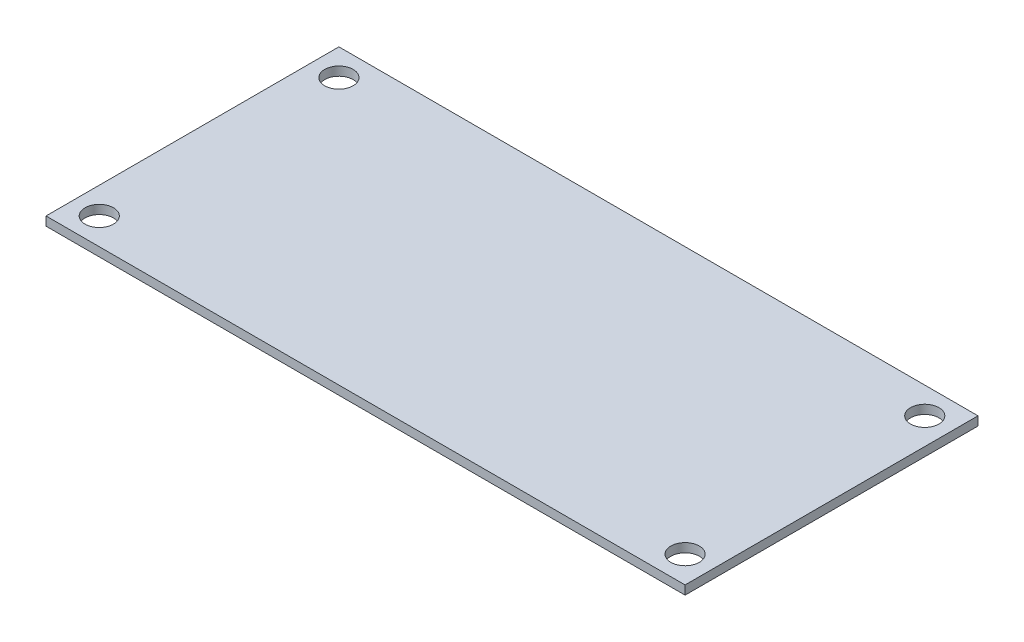
ISO-10303-21;
HEADER;
FILE_DESCRIPTION(('STEP AP214'),'2;1');
FILE_NAME('part.step','',(''),(''),'','','');
FILE_SCHEMA(('AUTOMOTIVE_DESIGN { 1 0 10303 214 1 1 1 1 }'));
ENDSEC;
DATA;
#1=APPLICATION_CONTEXT('core data for automotive mechanical design processes');
#2=APPLICATION_PROTOCOL_DEFINITION('international standard','automotive_design',2000,#1);
#3=PRODUCT_CONTEXT('',#1,'mechanical');
#4=PRODUCT('Part','Part','',(#3));
#5=PRODUCT_RELATED_PRODUCT_CATEGORY('part','',(#4));
#6=PRODUCT_DEFINITION_FORMATION('','',#4);
#7=PRODUCT_DEFINITION_CONTEXT('part definition',#1,'design');
#8=PRODUCT_DEFINITION('design','',#6,#7);
#9=PRODUCT_DEFINITION_SHAPE('','',#8);
#10=(LENGTH_UNIT() NAMED_UNIT(*) SI_UNIT(.MILLI.,.METRE.));
#11=(NAMED_UNIT(*) PLANE_ANGLE_UNIT() SI_UNIT($,.RADIAN.));
#12=(NAMED_UNIT(*) SI_UNIT($,.STERADIAN.) SOLID_ANGLE_UNIT());
#13=UNCERTAINTY_MEASURE_WITH_UNIT(LENGTH_MEASURE(1.E-05),#10,'distance_accuracy_value','');
#14=(GEOMETRIC_REPRESENTATION_CONTEXT(3) GLOBAL_UNCERTAINTY_ASSIGNED_CONTEXT((#13)) GLOBAL_UNIT_ASSIGNED_CONTEXT((#10,
#11,#12)) REPRESENTATION_CONTEXT('',''));
#15=CARTESIAN_POINT('',(0.,0.,0.));
#16=DIRECTION('',(0.,0.,1.));
#17=DIRECTION('',(1.,0.,0.));
#18=AXIS2_PLACEMENT_3D('',#15,#16,#17);
#19=CARTESIAN_POINT('',(36.,1.,-16.5));
#20=DIRECTION('',(-1.,0.,0.));
#21=DIRECTION('',(0.,0.,1.));
#22=AXIS2_PLACEMENT_3D('',#19,#20,#21);
#23=PLANE('',#22);
#24=DIRECTION('',(0.,0.,-1.));
#25=VECTOR('',#24,1.);
#26=CARTESIAN_POINT('',(36.,0.,-16.5));
#27=LINE('',#26,#25);
#28=CARTESIAN_POINT('',(36.,0.,16.5));
#29=VERTEX_POINT('',#28);
#30=CARTESIAN_POINT('',(36.,0.,-16.5));
#31=VERTEX_POINT('',#30);
#32=EDGE_CURVE('E96',#29,#31,#27,.T.);
#33=ORIENTED_EDGE('',*,*,#32,.T.);
#34=DIRECTION('',(0.,-1.,0.));
#35=VECTOR('',#34,1.);
#36=CARTESIAN_POINT('',(36.,1.,-16.5));
#37=LINE('',#36,#35);
#38=CARTESIAN_POINT('',(36.,1.,-16.5));
#39=VERTEX_POINT('',#38);
#40=EDGE_CURVE('E11',#39,#31,#37,.T.);
#41=ORIENTED_EDGE('',*,*,#40,.F.);
#42=DIRECTION('',(0.,0.,-1.));
#43=VECTOR('',#42,1.);
#44=CARTESIAN_POINT('',(36.,1.,-16.5));
#45=LINE('',#44,#43);
#46=CARTESIAN_POINT('',(36.,1.,16.5));
#47=VERTEX_POINT('',#46);
#48=EDGE_CURVE('E84',#47,#39,#45,.T.);
#49=ORIENTED_EDGE('',*,*,#48,.F.);
#50=DIRECTION('',(0.,-1.,0.));
#51=VECTOR('',#50,1.);
#52=CARTESIAN_POINT('',(36.,1.,16.5));
#53=LINE('',#52,#51);
#54=EDGE_CURVE('E92',#47,#29,#53,.T.);
#55=ORIENTED_EDGE('',*,*,#54,.T.);
#56=EDGE_LOOP('',(#33,#41,#49,#55));
#57=FACE_BOUND('',#56,.T.);
#58=ADVANCED_FACE('F33',(#57),#23,.F.);
#59=CARTESIAN_POINT('',(-36.,1.,-16.5));
#60=DIRECTION('',(0.,0.,1.));
#61=DIRECTION('',(1.,0.,0.));
#62=AXIS2_PLACEMENT_3D('',#59,#60,#61);
#63=PLANE('',#62);
#64=DIRECTION('',(-1.,0.,0.));
#65=VECTOR('',#64,1.);
#66=CARTESIAN_POINT('',(-36.,0.,-16.5));
#67=LINE('',#66,#65);
#68=CARTESIAN_POINT('',(-36.,0.,-16.5));
#69=VERTEX_POINT('',#68);
#70=EDGE_CURVE('E88',#31,#69,#67,.T.);
#71=ORIENTED_EDGE('',*,*,#70,.T.);
#72=DIRECTION('',(0.,-1.,0.));
#73=VECTOR('',#72,1.);
#74=CARTESIAN_POINT('',(-36.,1.,-16.5));
#75=LINE('',#74,#73);
#76=CARTESIAN_POINT('',(-36.,1.,-16.5));
#77=VERTEX_POINT('',#76);
#78=EDGE_CURVE('E41',#77,#69,#75,.T.);
#79=ORIENTED_EDGE('',*,*,#78,.F.);
#80=DIRECTION('',(-1.,0.,0.));
#81=VECTOR('',#80,1.);
#82=CARTESIAN_POINT('',(-36.,1.,-16.5));
#83=LINE('',#82,#81);
#84=EDGE_CURVE('E79',#39,#77,#83,.T.);
#85=ORIENTED_EDGE('',*,*,#84,.F.);
#86=ORIENTED_EDGE('',*,*,#40,.T.);
#87=EDGE_LOOP('',(#71,#79,#85,#86));
#88=FACE_BOUND('',#87,.T.);
#89=ADVANCED_FACE('F87',(#88),#63,.F.);
#90=CARTESIAN_POINT('',(-36.,1.,-16.5));
#91=DIRECTION('',(1.,0.,0.));
#92=DIRECTION('',(0.,0.,-1.));
#93=AXIS2_PLACEMENT_3D('',#90,#91,#92);
#94=PLANE('',#93);
#95=DIRECTION('',(0.,0.,1.));
#96=VECTOR('',#95,1.);
#97=CARTESIAN_POINT('',(-36.,0.,-16.5));
#98=LINE('',#97,#96);
#99=CARTESIAN_POINT('',(-36.,0.,16.5));
#100=VERTEX_POINT('',#99);
#101=EDGE_CURVE('E66',#69,#100,#98,.T.);
#102=ORIENTED_EDGE('',*,*,#101,.T.);
#103=DIRECTION('',(0.,-1.,0.));
#104=VECTOR('',#103,1.);
#105=CARTESIAN_POINT('',(-36.,1.,16.5));
#106=LINE('',#105,#104);
#107=CARTESIAN_POINT('',(-36.,1.,16.5));
#108=VERTEX_POINT('',#107);
#109=EDGE_CURVE('E89',#108,#100,#106,.T.);
#110=ORIENTED_EDGE('',*,*,#109,.F.);
#111=DIRECTION('',(0.,0.,1.));
#112=VECTOR('',#111,1.);
#113=CARTESIAN_POINT('',(-36.,1.,-16.5));
#114=LINE('',#113,#112);
#115=EDGE_CURVE('E82',#77,#108,#114,.T.);
#116=ORIENTED_EDGE('',*,*,#115,.F.);
#117=ORIENTED_EDGE('',*,*,#78,.T.);
#118=EDGE_LOOP('',(#102,#110,#116,#117));
#119=FACE_BOUND('',#118,.T.);
#120=ADVANCED_FACE('F90',(#119),#94,.F.);
#121=CARTESIAN_POINT('',(-36.,1.,16.5));
#122=DIRECTION('',(0.,0.,-1.));
#123=DIRECTION('',(-1.,0.,0.));
#124=AXIS2_PLACEMENT_3D('',#121,#122,#123);
#125=PLANE('',#124);
#126=DIRECTION('',(1.,0.,0.));
#127=VECTOR('',#126,1.);
#128=CARTESIAN_POINT('',(-36.,0.,16.5));
#129=LINE('',#128,#127);
#130=EDGE_CURVE('E72',#100,#29,#129,.T.);
#131=ORIENTED_EDGE('',*,*,#130,.T.);
#132=ORIENTED_EDGE('',*,*,#54,.F.);
#133=DIRECTION('',(1.,0.,0.));
#134=VECTOR('',#133,1.);
#135=CARTESIAN_POINT('',(-36.,1.,16.5));
#136=LINE('',#135,#134);
#137=EDGE_CURVE('E49',#108,#47,#136,.T.);
#138=ORIENTED_EDGE('',*,*,#137,.F.);
#139=ORIENTED_EDGE('',*,*,#109,.T.);
#140=EDGE_LOOP('',(#131,#132,#138,#139));
#141=FACE_BOUND('',#140,.T.);
#142=ADVANCED_FACE('F104',(#141),#125,.F.);
#143=CARTESIAN_POINT('',(0.,1.,0.));
#144=DIRECTION('',(0.,1.,0.));
#145=DIRECTION('',(0.,0.,1.));
#146=AXIS2_PLACEMENT_3D('',#143,#144,#145);
#147=PLANE('',#146);
#148=CARTESIAN_POINT('',(-33.,1.,-13.5));
#149=DIRECTION('',(0.,1.,0.));
#150=DIRECTION('',(0.,0.,-1.));
#151=AXIS2_PLACEMENT_3D('',#148,#149,#150);
#152=CIRCLE('',#151,1.6);
#153=CARTESIAN_POINT('',(-33.,1.,-15.1));
#154=VERTEX_POINT('',#153);
#155=EDGE_CURVE('E116',#154,#154,#152,.T.);
#156=ORIENTED_EDGE('',*,*,#155,.F.);
#157=EDGE_LOOP('',(#156));
#158=FACE_BOUND('',#157,.T.);
#159=CARTESIAN_POINT('',(-33.,1.,13.5));
#160=DIRECTION('',(0.,1.,0.));
#161=DIRECTION('',(0.,0.,1.));
#162=AXIS2_PLACEMENT_3D('',#159,#160,#161);
#163=CIRCLE('',#162,1.6);
#164=CARTESIAN_POINT('',(-33.,1.,15.1));
#165=VERTEX_POINT('',#164);
#166=EDGE_CURVE('E122',#165,#165,#163,.T.);
#167=ORIENTED_EDGE('',*,*,#166,.F.);
#168=EDGE_LOOP('',(#167));
#169=FACE_BOUND('',#168,.T.);
#170=CARTESIAN_POINT('',(33.,1.,13.5));
#171=DIRECTION('',(0.,1.,0.));
#172=DIRECTION('',(0.,0.,-1.));
#173=AXIS2_PLACEMENT_3D('',#170,#171,#172);
#174=CIRCLE('',#173,1.6);
#175=CARTESIAN_POINT('',(33.,1.,11.9));
#176=VERTEX_POINT('',#175);
#177=EDGE_CURVE('E128',#176,#176,#174,.T.);
#178=ORIENTED_EDGE('',*,*,#177,.F.);
#179=EDGE_LOOP('',(#178));
#180=FACE_BOUND('',#179,.T.);
#181=CARTESIAN_POINT('',(33.,1.,-13.5));
#182=DIRECTION('',(0.,1.,0.));
#183=DIRECTION('',(0.,0.,1.));
#184=AXIS2_PLACEMENT_3D('',#181,#182,#183);
#185=CIRCLE('',#184,1.6);
#186=CARTESIAN_POINT('',(33.,1.,-11.9));
#187=VERTEX_POINT('',#186);
#188=EDGE_CURVE('E110',#187,#187,#185,.T.);
#189=ORIENTED_EDGE('',*,*,#188,.F.);
#190=EDGE_LOOP('',(#189));
#191=FACE_BOUND('',#190,.T.);
#192=ORIENTED_EDGE('',*,*,#48,.T.);
#193=ORIENTED_EDGE('',*,*,#84,.T.);
#194=ORIENTED_EDGE('',*,*,#115,.T.);
#195=ORIENTED_EDGE('',*,*,#137,.T.);
#196=EDGE_LOOP('',(#192,#193,#194,#195));
#197=FACE_BOUND('',#196,.T.);
#198=ADVANCED_FACE('F80',(#158,#169,#180,#191,#197),#147,.T.);
#199=CARTESIAN_POINT('',(0.,0.,0.));
#200=DIRECTION('',(0.,1.,0.));
#201=DIRECTION('',(0.,0.,1.));
#202=AXIS2_PLACEMENT_3D('',#199,#200,#201);
#203=PLANE('',#202);
#204=CARTESIAN_POINT('',(-33.,0.,-13.5));
#205=DIRECTION('',(0.,1.,0.));
#206=DIRECTION('',(0.,0.,-1.));
#207=AXIS2_PLACEMENT_3D('',#204,#205,#206);
#208=CIRCLE('',#207,1.6);
#209=CARTESIAN_POINT('',(-33.,0.,-15.1));
#210=VERTEX_POINT('',#209);
#211=EDGE_CURVE('E119',#210,#210,#208,.T.);
#212=ORIENTED_EDGE('',*,*,#211,.T.);
#213=EDGE_LOOP('',(#212));
#214=FACE_BOUND('',#213,.T.);
#215=CARTESIAN_POINT('',(-33.,0.,13.5));
#216=DIRECTION('',(0.,1.,0.));
#217=DIRECTION('',(0.,0.,1.));
#218=AXIS2_PLACEMENT_3D('',#215,#216,#217);
#219=CIRCLE('',#218,1.6);
#220=CARTESIAN_POINT('',(-33.,0.,15.1));
#221=VERTEX_POINT('',#220);
#222=EDGE_CURVE('E125',#221,#221,#219,.T.);
#223=ORIENTED_EDGE('',*,*,#222,.T.);
#224=EDGE_LOOP('',(#223));
#225=FACE_BOUND('',#224,.T.);
#226=CARTESIAN_POINT('',(33.,0.,13.5));
#227=DIRECTION('',(0.,1.,0.));
#228=DIRECTION('',(0.,0.,-1.));
#229=AXIS2_PLACEMENT_3D('',#226,#227,#228);
#230=CIRCLE('',#229,1.6);
#231=CARTESIAN_POINT('',(33.,0.,11.9));
#232=VERTEX_POINT('',#231);
#233=EDGE_CURVE('E113',#232,#232,#230,.T.);
#234=ORIENTED_EDGE('',*,*,#233,.T.);
#235=EDGE_LOOP('',(#234));
#236=FACE_BOUND('',#235,.T.);
#237=CARTESIAN_POINT('',(33.,0.,-13.5));
#238=DIRECTION('',(0.,1.,0.));
#239=DIRECTION('',(0.,0.,1.));
#240=AXIS2_PLACEMENT_3D('',#237,#238,#239);
#241=CIRCLE('',#240,1.6);
#242=CARTESIAN_POINT('',(33.,0.,-11.9));
#243=VERTEX_POINT('',#242);
#244=EDGE_CURVE('E99',#243,#243,#241,.T.);
#245=ORIENTED_EDGE('',*,*,#244,.T.);
#246=EDGE_LOOP('',(#245));
#247=FACE_BOUND('',#246,.T.);
#248=ORIENTED_EDGE('',*,*,#32,.F.);
#249=ORIENTED_EDGE('',*,*,#130,.F.);
#250=ORIENTED_EDGE('',*,*,#101,.F.);
#251=ORIENTED_EDGE('',*,*,#70,.F.);
#252=EDGE_LOOP('',(#248,#249,#250,#251));
#253=FACE_BOUND('',#252,.T.);
#254=ADVANCED_FACE('F107',(#214,#225,#236,#247,#253),#203,.F.);
#255=CARTESIAN_POINT('',(33.,0.,-13.5));
#256=DIRECTION('',(0.,1.,0.));
#257=DIRECTION('',(0.,0.,1.));
#258=AXIS2_PLACEMENT_3D('',#255,#256,#257);
#259=CYLINDRICAL_SURFACE('',#258,1.6);
#260=ORIENTED_EDGE('',*,*,#244,.F.);
#261=EDGE_LOOP('',(#260));
#262=FACE_BOUND('',#261,.T.);
#263=ORIENTED_EDGE('',*,*,#188,.T.);
#264=EDGE_LOOP('',(#263));
#265=FACE_BOUND('',#264,.T.);
#266=ADVANCED_FACE('F140',(#262,#265),#259,.F.);
#267=CARTESIAN_POINT('',(33.,0.,13.5));
#268=DIRECTION('',(0.,1.,0.));
#269=DIRECTION('',(0.,0.,1.));
#270=AXIS2_PLACEMENT_3D('',#267,#268,#269);
#271=CYLINDRICAL_SURFACE('',#270,1.6);
#272=ORIENTED_EDGE('',*,*,#233,.F.);
#273=EDGE_LOOP('',(#272));
#274=FACE_BOUND('',#273,.T.);
#275=ORIENTED_EDGE('',*,*,#177,.T.);
#276=EDGE_LOOP('',(#275));
#277=FACE_BOUND('',#276,.T.);
#278=ADVANCED_FACE('F136',(#274,#277),#271,.F.);
#279=CARTESIAN_POINT('',(-33.,0.,13.5));
#280=DIRECTION('',(0.,1.,0.));
#281=DIRECTION('',(0.,0.,1.));
#282=AXIS2_PLACEMENT_3D('',#279,#280,#281);
#283=CYLINDRICAL_SURFACE('',#282,1.6);
#284=ORIENTED_EDGE('',*,*,#222,.F.);
#285=EDGE_LOOP('',(#284));
#286=FACE_BOUND('',#285,.T.);
#287=ORIENTED_EDGE('',*,*,#166,.T.);
#288=EDGE_LOOP('',(#287));
#289=FACE_BOUND('',#288,.T.);
#290=ADVANCED_FACE('F139',(#286,#289),#283,.F.);
#291=CARTESIAN_POINT('',(-33.,0.,-13.5));
#292=DIRECTION('',(0.,1.,0.));
#293=DIRECTION('',(0.,0.,1.));
#294=AXIS2_PLACEMENT_3D('',#291,#292,#293);
#295=CYLINDRICAL_SURFACE('',#294,1.6);
#296=ORIENTED_EDGE('',*,*,#211,.F.);
#297=EDGE_LOOP('',(#296));
#298=FACE_BOUND('',#297,.T.);
#299=ORIENTED_EDGE('',*,*,#155,.T.);
#300=EDGE_LOOP('',(#299));
#301=FACE_BOUND('',#300,.T.);
#302=ADVANCED_FACE('F201',(#298,#301),#295,.F.);
#303=CLOSED_SHELL('',(#58,#89,#120,#142,#198,#254,#266,#278,#290,#302));
#304=MANIFOLD_SOLID_BREP('B2',#303);
#305=ADVANCED_BREP_SHAPE_REPRESENTATION('',(#18,#304),#14);
#306=SHAPE_DEFINITION_REPRESENTATION(#9,#305);
ENDSEC;
END-ISO-10303-21;
